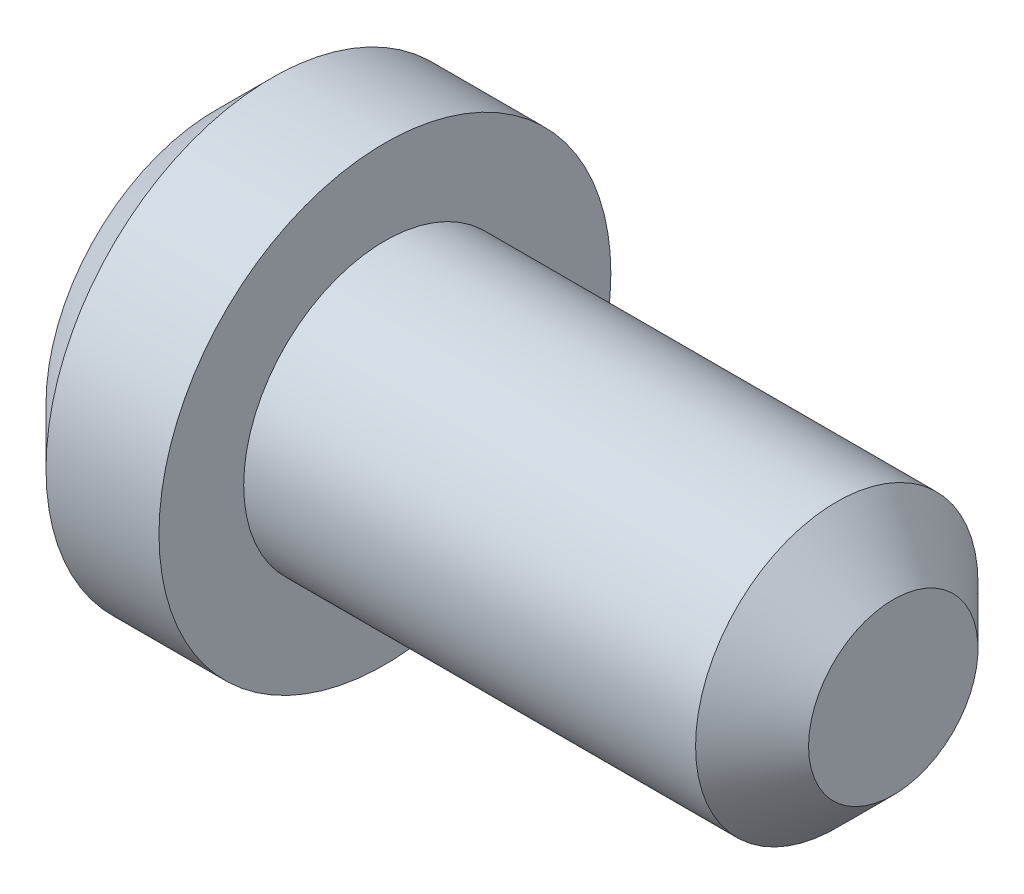
ISO-10303-21;
HEADER;
FILE_DESCRIPTION(('STEP AP214'),'2;1');
FILE_NAME('part.step','',(''),(''),'','','');
FILE_SCHEMA(('AUTOMOTIVE_DESIGN { 1 0 10303 214 1 1 1 1 }'));
ENDSEC;
DATA;
#1=APPLICATION_CONTEXT('core data for automotive mechanical design processes');
#2=APPLICATION_PROTOCOL_DEFINITION('international standard','automotive_design',2000,#1);
#3=PRODUCT_CONTEXT('',#1,'mechanical');
#4=PRODUCT('Part','Part','',(#3));
#5=PRODUCT_RELATED_PRODUCT_CATEGORY('part','',(#4));
#6=PRODUCT_DEFINITION_FORMATION('','',#4);
#7=PRODUCT_DEFINITION_CONTEXT('part definition',#1,'design');
#8=PRODUCT_DEFINITION('design','',#6,#7);
#9=PRODUCT_DEFINITION_SHAPE('','',#8);
#10=(LENGTH_UNIT() NAMED_UNIT(*) SI_UNIT(.MILLI.,.METRE.));
#11=(NAMED_UNIT(*) PLANE_ANGLE_UNIT() SI_UNIT($,.RADIAN.));
#12=(NAMED_UNIT(*) SI_UNIT($,.STERADIAN.) SOLID_ANGLE_UNIT());
#13=UNCERTAINTY_MEASURE_WITH_UNIT(LENGTH_MEASURE(1.E-05),#10,'distance_accuracy_value','');
#14=(GEOMETRIC_REPRESENTATION_CONTEXT(3) GLOBAL_UNCERTAINTY_ASSIGNED_CONTEXT((#13)) GLOBAL_UNIT_ASSIGNED_CONTEXT((#10,
#11,#12)) REPRESENTATION_CONTEXT('',''));
#15=CARTESIAN_POINT('',(0.,0.,0.));
#16=DIRECTION('',(0.,0.,1.));
#17=DIRECTION('',(1.,0.,0.));
#18=AXIS2_PLACEMENT_3D('',#15,#16,#17);
#19=CARTESIAN_POINT('',(-10.,0.,0.));
#20=DIRECTION('',(-1.,0.,0.));
#21=DIRECTION('',(0.,0.,1.));
#22=AXIS2_PLACEMENT_3D('',#19,#20,#21);
#23=CYLINDRICAL_SURFACE('',#22,25.);
#24=CARTESIAN_POINT('',(20.,0.,0.));
#25=DIRECTION('',(-1.,0.,0.));
#26=DIRECTION('',(0.,0.,1.));
#27=AXIS2_PLACEMENT_3D('',#24,#25,#26);
#28=CIRCLE('',#27,25.);
#29=CARTESIAN_POINT('',(20.,0.,25.));
#30=VERTEX_POINT('',#29);
#31=EDGE_CURVE('E10',#30,#30,#28,.T.);
#32=ORIENTED_EDGE('',*,*,#31,.F.);
#33=EDGE_LOOP('',(#32));
#34=FACE_BOUND('',#33,.T.);
#35=CARTESIAN_POINT('',(100.,0.,0.));
#36=DIRECTION('',(-1.,0.,0.));
#37=DIRECTION('',(0.,0.,1.));
#38=AXIS2_PLACEMENT_3D('',#35,#36,#37);
#39=CIRCLE('',#38,25.);
#40=CARTESIAN_POINT('',(100.,0.,25.));
#41=VERTEX_POINT('',#40);
#42=EDGE_CURVE('E53',#41,#41,#39,.T.);
#43=ORIENTED_EDGE('',*,*,#42,.T.);
#44=EDGE_LOOP('',(#43));
#45=FACE_BOUND('',#44,.T.);
#46=ADVANCED_FACE('F31',(#34,#45),#23,.T.);
#47=CARTESIAN_POINT('',(20.,25.,0.));
#48=DIRECTION('',(-1.,0.,0.));
#49=DIRECTION('',(0.,0.,1.));
#50=AXIS2_PLACEMENT_3D('',#47,#48,#49);
#51=PLANE('',#50);
#52=CARTESIAN_POINT('',(20.,0.,0.));
#53=DIRECTION('',(-1.,0.,0.));
#54=DIRECTION('',(0.,0.,1.));
#55=AXIS2_PLACEMENT_3D('',#52,#53,#54);
#56=CIRCLE('',#55,40.);
#57=CARTESIAN_POINT('',(20.,0.,40.));
#58=VERTEX_POINT('',#57);
#59=EDGE_CURVE('E37',#58,#58,#56,.T.);
#60=ORIENTED_EDGE('',*,*,#59,.F.);
#61=EDGE_LOOP('',(#60));
#62=FACE_BOUND('',#61,.T.);
#63=ORIENTED_EDGE('',*,*,#31,.T.);
#64=EDGE_LOOP('',(#63));
#65=FACE_BOUND('',#64,.T.);
#66=ADVANCED_FACE('F75',(#62,#65),#51,.F.);
#67=CARTESIAN_POINT('',(-10.,0.,0.));
#68=DIRECTION('',(-1.,0.,0.));
#69=DIRECTION('',(0.,0.,1.));
#70=AXIS2_PLACEMENT_3D('',#67,#68,#69);
#71=CYLINDRICAL_SURFACE('',#70,40.);
#72=CARTESIAN_POINT('',(0.,0.,0.));
#73=DIRECTION('',(-1.,0.,0.));
#74=DIRECTION('',(0.,0.,1.));
#75=AXIS2_PLACEMENT_3D('',#72,#73,#74);
#76=CIRCLE('',#75,40.);
#77=CARTESIAN_POINT('',(0.,0.,40.));
#78=VERTEX_POINT('',#77);
#79=EDGE_CURVE('E41',#78,#78,#76,.T.);
#80=ORIENTED_EDGE('',*,*,#79,.F.);
#81=EDGE_LOOP('',(#80));
#82=FACE_BOUND('',#81,.T.);
#83=ORIENTED_EDGE('',*,*,#59,.T.);
#84=EDGE_LOOP('',(#83));
#85=FACE_BOUND('',#84,.T.);
#86=ADVANCED_FACE('F80',(#82,#85),#71,.T.);
#87=CARTESIAN_POINT('',(0.,0.,0.));
#88=DIRECTION('',(1.,0.,0.));
#89=DIRECTION('',(0.,0.,-1.));
#90=AXIS2_PLACEMENT_3D('',#87,#88,#89);
#91=CONICAL_SURFACE('',#90,40.,0.78539816339745);
#92=CARTESIAN_POINT('',(-10.,0.,0.));
#93=DIRECTION('',(-1.,0.,0.));
#94=DIRECTION('',(0.,0.,1.));
#95=AXIS2_PLACEMENT_3D('',#92,#93,#94);
#96=CIRCLE('',#95,30.);
#97=CARTESIAN_POINT('',(-10.,0.,30.));
#98=VERTEX_POINT('',#97);
#99=EDGE_CURVE('E45',#98,#98,#96,.T.);
#100=ORIENTED_EDGE('',*,*,#99,.F.);
#101=EDGE_LOOP('',(#100));
#102=FACE_BOUND('',#101,.T.);
#103=ORIENTED_EDGE('',*,*,#79,.T.);
#104=EDGE_LOOP('',(#103));
#105=FACE_BOUND('',#104,.T.);
#106=ADVANCED_FACE('F71',(#102,#105),#91,.T.);
#107=CARTESIAN_POINT('',(-10.,30.,0.));
#108=DIRECTION('',(1.,0.,0.));
#109=DIRECTION('',(0.,0.,-1.));
#110=AXIS2_PLACEMENT_3D('',#107,#108,#109);
#111=PLANE('',#110);
#112=ORIENTED_EDGE('',*,*,#99,.T.);
#113=EDGE_LOOP('',(#112));
#114=FACE_BOUND('',#113,.T.);
#115=ADVANCED_FACE('F66',(#114),#111,.F.);
#116=CARTESIAN_POINT('',(110.,0.,0.));
#117=DIRECTION('',(-1.,0.,0.));
#118=DIRECTION('',(0.,0.,1.));
#119=AXIS2_PLACEMENT_3D('',#116,#117,#118);
#120=PLANE('',#119);
#121=CARTESIAN_POINT('',(110.,0.,0.));
#122=DIRECTION('',(-1.,0.,0.));
#123=DIRECTION('',(0.,0.,1.));
#124=AXIS2_PLACEMENT_3D('',#121,#122,#123);
#125=CIRCLE('',#124,15.);
#126=CARTESIAN_POINT('',(110.,0.,15.));
#127=VERTEX_POINT('',#126);
#128=EDGE_CURVE('E50',#127,#127,#125,.T.);
#129=ORIENTED_EDGE('',*,*,#128,.F.);
#130=EDGE_LOOP('',(#129));
#131=FACE_BOUND('',#130,.T.);
#132=ADVANCED_FACE('F61',(#131),#120,.F.);
#133=CARTESIAN_POINT('',(110.,0.,0.));
#134=DIRECTION('',(-1.,0.,0.));
#135=DIRECTION('',(0.,0.,1.));
#136=AXIS2_PLACEMENT_3D('',#133,#134,#135);
#137=CONICAL_SURFACE('',#136,15.,0.785398163397447);
#138=ORIENTED_EDGE('',*,*,#42,.F.);
#139=EDGE_LOOP('',(#138));
#140=FACE_BOUND('',#139,.T.);
#141=ORIENTED_EDGE('',*,*,#128,.T.);
#142=EDGE_LOOP('',(#141));
#143=FACE_BOUND('',#142,.T.);
#144=ADVANCED_FACE('F58',(#140,#143),#137,.T.);
#145=CLOSED_SHELL('',(#46,#66,#86,#106,#115,#132,#144));
#146=MANIFOLD_SOLID_BREP('B2',#145);
#147=ADVANCED_BREP_SHAPE_REPRESENTATION('',(#18,#146),#14);
#148=SHAPE_DEFINITION_REPRESENTATION(#9,#147);
ENDSEC;
END-ISO-10303-21;
